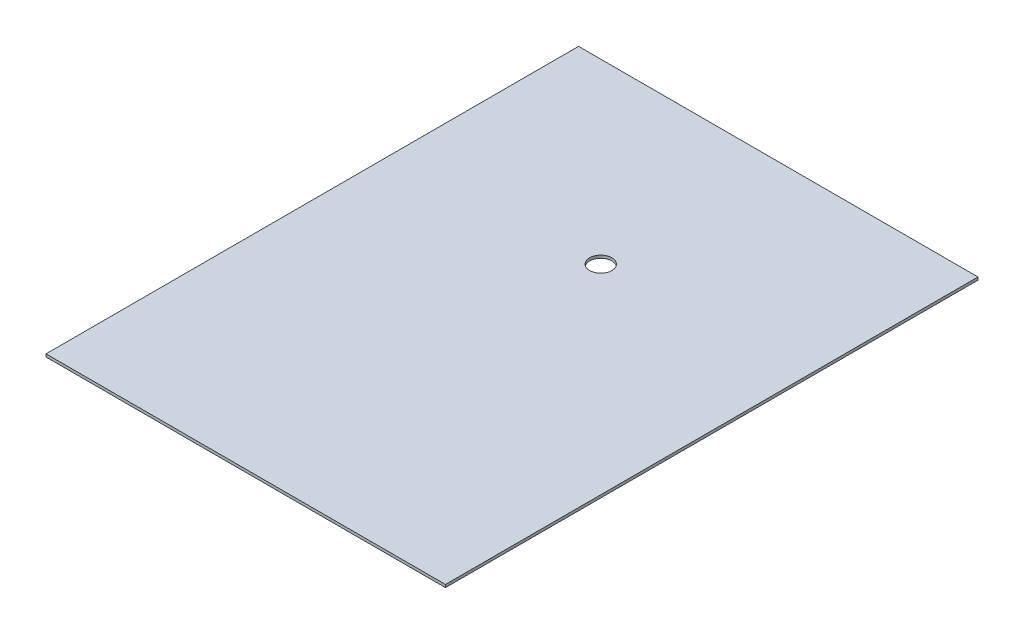
ISO-10303-21;
HEADER;
FILE_DESCRIPTION(('STEP AP214'),'2;1');
FILE_NAME('part.step','',(''),(''),'','','');
FILE_SCHEMA(('AUTOMOTIVE_DESIGN { 1 0 10303 214 1 1 1 1 }'));
ENDSEC;
DATA;
#1=APPLICATION_CONTEXT('core data for automotive mechanical design processes');
#2=APPLICATION_PROTOCOL_DEFINITION('international standard','automotive_design',2000,#1);
#3=PRODUCT_CONTEXT('',#1,'mechanical');
#4=PRODUCT('Part','Part','',(#3));
#5=PRODUCT_RELATED_PRODUCT_CATEGORY('part','',(#4));
#6=PRODUCT_DEFINITION_FORMATION('','',#4);
#7=PRODUCT_DEFINITION_CONTEXT('part definition',#1,'design');
#8=PRODUCT_DEFINITION('design','',#6,#7);
#9=PRODUCT_DEFINITION_SHAPE('','',#8);
#10=(LENGTH_UNIT() NAMED_UNIT(*) SI_UNIT(.MILLI.,.METRE.));
#11=(NAMED_UNIT(*) PLANE_ANGLE_UNIT() SI_UNIT($,.RADIAN.));
#12=(NAMED_UNIT(*) SI_UNIT($,.STERADIAN.) SOLID_ANGLE_UNIT());
#13=UNCERTAINTY_MEASURE_WITH_UNIT(LENGTH_MEASURE(1.E-05),#10,'distance_accuracy_value','');
#14=(GEOMETRIC_REPRESENTATION_CONTEXT(3) GLOBAL_UNCERTAINTY_ASSIGNED_CONTEXT((#13)) GLOBAL_UNIT_ASSIGNED_CONTEXT((#10,
#11,#12)) REPRESENTATION_CONTEXT('',''));
#15=CARTESIAN_POINT('',(0.,0.,0.));
#16=DIRECTION('',(0.,0.,1.));
#17=DIRECTION('',(1.,0.,0.));
#18=AXIS2_PLACEMENT_3D('',#15,#16,#17);
#19=CARTESIAN_POINT('',(0.,3.175,0.));
#20=DIRECTION('',(0.,1.,0.));
#21=DIRECTION('',(0.,0.,1.));
#22=AXIS2_PLACEMENT_3D('',#19,#20,#21);
#23=PLANE('',#22);
#24=DIRECTION('',(0.,0.,1.));
#25=VECTOR('',#24,1.);
#26=CARTESIAN_POINT('',(-228.6,3.175,-304.8));
#27=LINE('',#26,#25);
#28=CARTESIAN_POINT('',(-228.6,3.175,-304.8));
#29=VERTEX_POINT('',#28);
#30=CARTESIAN_POINT('',(-228.6,3.175,304.8));
#31=VERTEX_POINT('',#30);
#32=EDGE_CURVE('E87',#29,#31,#27,.T.);
#33=ORIENTED_EDGE('',*,*,#32,.T.);
#34=DIRECTION('',(1.,0.,0.));
#35=VECTOR('',#34,1.);
#36=CARTESIAN_POINT('',(-228.6,3.175,304.8));
#37=LINE('',#36,#35);
#38=CARTESIAN_POINT('',(228.6,3.175,304.8));
#39=VERTEX_POINT('',#38);
#40=EDGE_CURVE('E82',#31,#39,#37,.T.);
#41=ORIENTED_EDGE('',*,*,#40,.T.);
#42=DIRECTION('',(0.,0.,-1.));
#43=VECTOR('',#42,1.);
#44=CARTESIAN_POINT('',(228.6,3.175,-304.8));
#45=LINE('',#44,#43);
#46=CARTESIAN_POINT('',(228.6,3.175,-304.8));
#47=VERTEX_POINT('',#46);
#48=EDGE_CURVE('E85',#39,#47,#45,.T.);
#49=ORIENTED_EDGE('',*,*,#48,.T.);
#50=DIRECTION('',(-1.,0.,0.));
#51=VECTOR('',#50,1.);
#52=CARTESIAN_POINT('',(-228.6,3.175,-304.8));
#53=LINE('',#52,#51);
#54=EDGE_CURVE('E52',#47,#29,#53,.T.);
#55=ORIENTED_EDGE('',*,*,#54,.T.);
#56=EDGE_LOOP('',(#33,#41,#49,#55));
#57=FACE_BOUND('',#56,.T.);
#58=CARTESIAN_POINT('',(0.,3.175,-101.6));
#59=DIRECTION('',(0.,1.,0.));
#60=DIRECTION('',(0.,0.,1.));
#61=AXIS2_PLACEMENT_3D('',#58,#59,#60);
#62=CIRCLE('',#61,12.7);
#63=CARTESIAN_POINT('',(0.,3.175,-88.9));
#64=VERTEX_POINT('',#63);
#65=EDGE_CURVE('E102',#64,#64,#62,.T.);
#66=ORIENTED_EDGE('',*,*,#65,.F.);
#67=EDGE_LOOP('',(#66));
#68=FACE_BOUND('',#67,.T.);
#69=ADVANCED_FACE('F35',(#57,#68),#23,.T.);
#70=CARTESIAN_POINT('',(0.,0.,0.));
#71=DIRECTION('',(0.,1.,0.));
#72=DIRECTION('',(0.,0.,1.));
#73=AXIS2_PLACEMENT_3D('',#70,#71,#72);
#74=PLANE('',#73);
#75=DIRECTION('',(0.,0.,1.));
#76=VECTOR('',#75,1.);
#77=CARTESIAN_POINT('',(-228.6,0.,-304.8));
#78=LINE('',#77,#76);
#79=CARTESIAN_POINT('',(-228.6,0.,-304.8));
#80=VERTEX_POINT('',#79);
#81=CARTESIAN_POINT('',(-228.6,0.,304.8));
#82=VERTEX_POINT('',#81);
#83=EDGE_CURVE('E99',#80,#82,#78,.T.);
#84=ORIENTED_EDGE('',*,*,#83,.F.);
#85=DIRECTION('',(-1.,0.,0.));
#86=VECTOR('',#85,1.);
#87=CARTESIAN_POINT('',(-228.6,0.,-304.8));
#88=LINE('',#87,#86);
#89=CARTESIAN_POINT('',(228.6,0.,-304.8));
#90=VERTEX_POINT('',#89);
#91=EDGE_CURVE('E75',#90,#80,#88,.T.);
#92=ORIENTED_EDGE('',*,*,#91,.F.);
#93=DIRECTION('',(0.,0.,-1.));
#94=VECTOR('',#93,1.);
#95=CARTESIAN_POINT('',(228.6,0.,-304.8));
#96=LINE('',#95,#94);
#97=CARTESIAN_POINT('',(228.6,0.,304.8));
#98=VERTEX_POINT('',#97);
#99=EDGE_CURVE('E69',#98,#90,#96,.T.);
#100=ORIENTED_EDGE('',*,*,#99,.F.);
#101=DIRECTION('',(1.,0.,0.));
#102=VECTOR('',#101,1.);
#103=CARTESIAN_POINT('',(-228.6,0.,304.8));
#104=LINE('',#103,#102);
#105=EDGE_CURVE('E91',#82,#98,#104,.T.);
#106=ORIENTED_EDGE('',*,*,#105,.F.);
#107=EDGE_LOOP('',(#84,#92,#100,#106));
#108=FACE_BOUND('',#107,.T.);
#109=CARTESIAN_POINT('',(0.,0.,-101.6));
#110=DIRECTION('',(0.,1.,0.));
#111=DIRECTION('',(0.,0.,1.));
#112=AXIS2_PLACEMENT_3D('',#109,#110,#111);
#113=CIRCLE('',#112,12.7);
#114=CARTESIAN_POINT('',(0.,0.,-88.9));
#115=VERTEX_POINT('',#114);
#116=EDGE_CURVE('E114',#115,#115,#113,.T.);
#117=ORIENTED_EDGE('',*,*,#116,.T.);
#118=EDGE_LOOP('',(#117));
#119=FACE_BOUND('',#118,.T.);
#120=ADVANCED_FACE('F110',(#108,#119),#74,.F.);
#121=CARTESIAN_POINT('',(-228.6,3.175,-304.8));
#122=DIRECTION('',(1.,0.,0.));
#123=DIRECTION('',(0.,0.,-1.));
#124=AXIS2_PLACEMENT_3D('',#121,#122,#123);
#125=PLANE('',#124);
#126=ORIENTED_EDGE('',*,*,#83,.T.);
#127=DIRECTION('',(0.,-1.,0.));
#128=VECTOR('',#127,1.);
#129=CARTESIAN_POINT('',(-228.6,3.175,304.8));
#130=LINE('',#129,#128);
#131=EDGE_CURVE('E11',#31,#82,#130,.T.);
#132=ORIENTED_EDGE('',*,*,#131,.F.);
#133=ORIENTED_EDGE('',*,*,#32,.F.);
#134=DIRECTION('',(0.,-1.,0.));
#135=VECTOR('',#134,1.);
#136=CARTESIAN_POINT('',(-228.6,3.175,-304.8));
#137=LINE('',#136,#135);
#138=EDGE_CURVE('E95',#29,#80,#137,.T.);
#139=ORIENTED_EDGE('',*,*,#138,.T.);
#140=EDGE_LOOP('',(#126,#132,#133,#139));
#141=FACE_BOUND('',#140,.T.);
#142=ADVANCED_FACE('F37',(#141),#125,.F.);
#143=CARTESIAN_POINT('',(-228.6,3.175,304.8));
#144=DIRECTION('',(0.,0.,-1.));
#145=DIRECTION('',(-1.,0.,0.));
#146=AXIS2_PLACEMENT_3D('',#143,#144,#145);
#147=PLANE('',#146);
#148=ORIENTED_EDGE('',*,*,#105,.T.);
#149=DIRECTION('',(0.,-1.,0.));
#150=VECTOR('',#149,1.);
#151=CARTESIAN_POINT('',(228.6,3.175,304.8));
#152=LINE('',#151,#150);
#153=EDGE_CURVE('E44',#39,#98,#152,.T.);
#154=ORIENTED_EDGE('',*,*,#153,.F.);
#155=ORIENTED_EDGE('',*,*,#40,.F.);
#156=ORIENTED_EDGE('',*,*,#131,.T.);
#157=EDGE_LOOP('',(#148,#154,#155,#156));
#158=FACE_BOUND('',#157,.T.);
#159=ADVANCED_FACE('F90',(#158),#147,.F.);
#160=CARTESIAN_POINT('',(228.6,3.175,-304.8));
#161=DIRECTION('',(-1.,0.,0.));
#162=DIRECTION('',(0.,0.,1.));
#163=AXIS2_PLACEMENT_3D('',#160,#161,#162);
#164=PLANE('',#163);
#165=ORIENTED_EDGE('',*,*,#99,.T.);
#166=DIRECTION('',(0.,-1.,0.));
#167=VECTOR('',#166,1.);
#168=CARTESIAN_POINT('',(228.6,3.175,-304.8));
#169=LINE('',#168,#167);
#170=EDGE_CURVE('E92',#47,#90,#169,.T.);
#171=ORIENTED_EDGE('',*,*,#170,.F.);
#172=ORIENTED_EDGE('',*,*,#48,.F.);
#173=ORIENTED_EDGE('',*,*,#153,.T.);
#174=EDGE_LOOP('',(#165,#171,#172,#173));
#175=FACE_BOUND('',#174,.T.);
#176=ADVANCED_FACE('F93',(#175),#164,.F.);
#177=CARTESIAN_POINT('',(-228.6,3.175,-304.8));
#178=DIRECTION('',(0.,0.,1.));
#179=DIRECTION('',(1.,0.,0.));
#180=AXIS2_PLACEMENT_3D('',#177,#178,#179);
#181=PLANE('',#180);
#182=ORIENTED_EDGE('',*,*,#91,.T.);
#183=ORIENTED_EDGE('',*,*,#138,.F.);
#184=ORIENTED_EDGE('',*,*,#54,.F.);
#185=ORIENTED_EDGE('',*,*,#170,.T.);
#186=EDGE_LOOP('',(#182,#183,#184,#185));
#187=FACE_BOUND('',#186,.T.);
#188=ADVANCED_FACE('F107',(#187),#181,.F.);
#189=CARTESIAN_POINT('',(0.,3.175,-101.6));
#190=DIRECTION('',(0.,-1.,0.));
#191=DIRECTION('',(0.,0.,-1.));
#192=AXIS2_PLACEMENT_3D('',#189,#190,#191);
#193=CYLINDRICAL_SURFACE('',#192,12.7);
#194=ORIENTED_EDGE('',*,*,#65,.T.);
#195=EDGE_LOOP('',(#194));
#196=FACE_BOUND('',#195,.T.);
#197=ORIENTED_EDGE('',*,*,#116,.F.);
#198=EDGE_LOOP('',(#197));
#199=FACE_BOUND('',#198,.T.);
#200=ADVANCED_FACE('F120',(#196,#199),#193,.F.);
#201=CLOSED_SHELL('',(#69,#120,#142,#159,#176,#188,#200));
#202=MANIFOLD_SOLID_BREP('B2',#201);
#203=ADVANCED_BREP_SHAPE_REPRESENTATION('',(#18,#202),#14);
#204=SHAPE_DEFINITION_REPRESENTATION(#9,#203);
ENDSEC;
END-ISO-10303-21;
